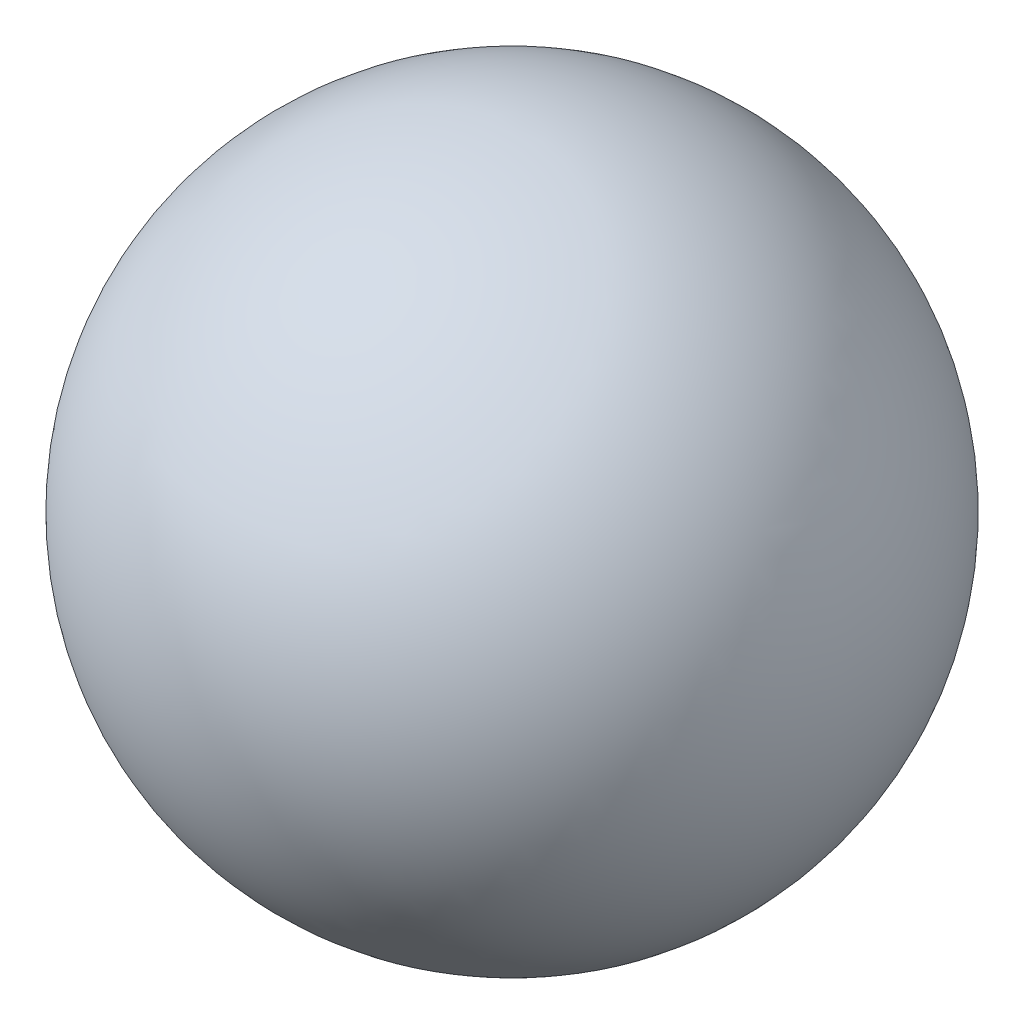
ISO-10303-21;
HEADER;
FILE_DESCRIPTION(('STEP AP214'),'2;1');
FILE_NAME('part.step','',(''),(''),'','','');
FILE_SCHEMA(('AUTOMOTIVE_DESIGN { 1 0 10303 214 1 1 1 1 }'));
ENDSEC;
DATA;
#1=APPLICATION_CONTEXT('core data for automotive mechanical design processes');
#2=APPLICATION_PROTOCOL_DEFINITION('international standard','automotive_design',2000,#1);
#3=PRODUCT_CONTEXT('',#1,'mechanical');
#4=PRODUCT('Part','Part','',(#3));
#5=PRODUCT_RELATED_PRODUCT_CATEGORY('part','',(#4));
#6=PRODUCT_DEFINITION_FORMATION('','',#4);
#7=PRODUCT_DEFINITION_CONTEXT('part definition',#1,'design');
#8=PRODUCT_DEFINITION('design','',#6,#7);
#9=PRODUCT_DEFINITION_SHAPE('','',#8);
#10=(LENGTH_UNIT() NAMED_UNIT(*) SI_UNIT(.MILLI.,.METRE.));
#11=(NAMED_UNIT(*) PLANE_ANGLE_UNIT() SI_UNIT($,.RADIAN.));
#12=(NAMED_UNIT(*) SI_UNIT($,.STERADIAN.) SOLID_ANGLE_UNIT());
#13=UNCERTAINTY_MEASURE_WITH_UNIT(LENGTH_MEASURE(1.E-05),#10,'distance_accuracy_value','');
#14=(GEOMETRIC_REPRESENTATION_CONTEXT(3) GLOBAL_UNCERTAINTY_ASSIGNED_CONTEXT((#13)) GLOBAL_UNIT_ASSIGNED_CONTEXT((#10,
#11,#12)) REPRESENTATION_CONTEXT('',''));
#15=CARTESIAN_POINT('',(0.,0.,0.));
#16=DIRECTION('',(0.,0.,1.));
#17=DIRECTION('',(1.,0.,0.));
#18=AXIS2_PLACEMENT_3D('',#15,#16,#17);
#19=CARTESIAN_POINT('',(0.,0.,0.));
#20=DIRECTION('',(0.,1.,0.));
#21=DIRECTION('',(1.,0.,0.));
#22=AXIS2_PLACEMENT_3D('',#19,#20,#21);
#23=SPHERICAL_SURFACE('',#22,4.);
#24=CARTESIAN_POINT('',(0.,-4.,0.));
#25=VERTEX_POINT('',#24);
#26=VERTEX_LOOP('',#25);
#27=FACE_BOUND('',#26,.T.);
#28=CARTESIAN_POINT('',(0.,4.,0.));
#29=VERTEX_POINT('',#28);
#30=VERTEX_LOOP('',#29);
#31=FACE_BOUND('',#30,.T.);
#32=ADVANCED_FACE('F15',(#27,#31),#23,.T.);
#33=CLOSED_SHELL('',(#32));
#34=MANIFOLD_SOLID_BREP('B1',#33);
#35=ADVANCED_BREP_SHAPE_REPRESENTATION('',(#18,#34),#14);
#36=SHAPE_DEFINITION_REPRESENTATION(#9,#35);
ENDSEC;
END-ISO-10303-21;
